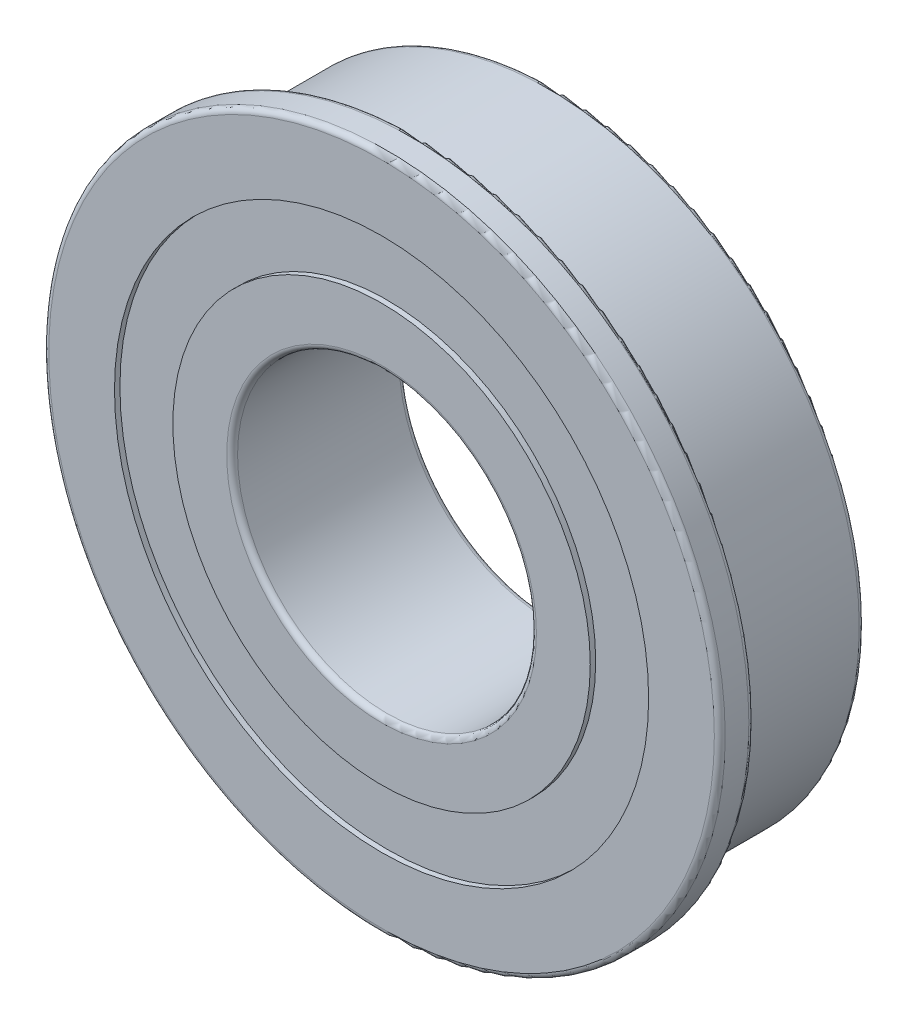
ISO-10303-21;
HEADER;
FILE_DESCRIPTION(('STEP AP214'),'2;1');
FILE_NAME('part.step','',(''),(''),'','','');
FILE_SCHEMA(('AUTOMOTIVE_DESIGN { 1 0 10303 214 1 1 1 1 }'));
ENDSEC;
DATA;
#1=APPLICATION_CONTEXT('core data for automotive mechanical design processes');
#2=APPLICATION_PROTOCOL_DEFINITION('international standard','automotive_design',2000,#1);
#3=PRODUCT_CONTEXT('',#1,'mechanical');
#4=PRODUCT('Part','Part','',(#3));
#5=PRODUCT_RELATED_PRODUCT_CATEGORY('part','',(#4));
#6=PRODUCT_DEFINITION_FORMATION('','',#4);
#7=PRODUCT_DEFINITION_CONTEXT('part definition',#1,'design');
#8=PRODUCT_DEFINITION('design','',#6,#7);
#9=PRODUCT_DEFINITION_SHAPE('','',#8);
#10=(LENGTH_UNIT() NAMED_UNIT(*) SI_UNIT(.MILLI.,.METRE.));
#11=(NAMED_UNIT(*) PLANE_ANGLE_UNIT() SI_UNIT($,.RADIAN.));
#12=(NAMED_UNIT(*) SI_UNIT($,.STERADIAN.) SOLID_ANGLE_UNIT());
#13=UNCERTAINTY_MEASURE_WITH_UNIT(LENGTH_MEASURE(1.E-05),#10,'distance_accuracy_value','');
#14=(GEOMETRIC_REPRESENTATION_CONTEXT(3) GLOBAL_UNCERTAINTY_ASSIGNED_CONTEXT((#13)) GLOBAL_UNIT_ASSIGNED_CONTEXT((#10,
#11,#12)) REPRESENTATION_CONTEXT('',''));
#15=CARTESIAN_POINT('',(0.,0.,0.));
#16=DIRECTION('',(0.,0.,1.));
#17=DIRECTION('',(1.,0.,0.));
#18=AXIS2_PLACEMENT_3D('',#15,#16,#17);
#19=CARTESIAN_POINT('',(0.,0.,-3.7187500000015));
#20=DIRECTION('',(0.,0.,1.));
#21=DIRECTION('',(1.,0.,0.));
#22=AXIS2_PLACEMENT_3D('',#19,#20,#21);
#23=TOROIDAL_SURFACE('',#22,14.0375000000005,0.249999999999001);
#24=CARTESIAN_POINT('',(0.,0.,-3.9687500000005));
#25=DIRECTION('',(0.,0.,1.));
#26=DIRECTION('',(1.,0.,0.));
#27=AXIS2_PLACEMENT_3D('',#24,#25,#26);
#28=CIRCLE('',#27,14.0375000000005);
#29=CARTESIAN_POINT('',(14.0375000000005,0.,-3.9687500000005));
#30=VERTEX_POINT('',#29);
#31=EDGE_CURVE('E10',#30,#30,#28,.T.);
#32=ORIENTED_EDGE('',*,*,#31,.T.);
#33=EDGE_LOOP('',(#32));
#34=FACE_BOUND('',#33,.T.);
#35=CARTESIAN_POINT('',(0.,0.,-3.7187500000015));
#36=DIRECTION('',(0.,0.,1.));
#37=DIRECTION('',(1.,0.,0.));
#38=AXIS2_PLACEMENT_3D('',#35,#36,#37);
#39=CIRCLE('',#38,14.2874999999995);
#40=CARTESIAN_POINT('',(14.2874999999995,0.,-3.7187500000015));
#41=VERTEX_POINT('',#40);
#42=EDGE_CURVE('E97',#41,#41,#39,.T.);
#43=ORIENTED_EDGE('',*,*,#42,.F.);
#44=EDGE_LOOP('',(#43));
#45=FACE_BOUND('',#44,.T.);
#46=ADVANCED_FACE('F30',(#34,#45),#23,.T.);
#47=CARTESIAN_POINT('',(14.0375000000005,0.,-3.9687500000005));
#48=DIRECTION('',(0.,0.,-1.));
#49=DIRECTION('',(-1.,0.,0.));
#50=AXIS2_PLACEMENT_3D('',#47,#48,#49);
#51=PLANE('',#50);
#52=CARTESIAN_POINT('',(0.,0.,-3.9687500000005));
#53=DIRECTION('',(0.,0.,1.));
#54=DIRECTION('',(1.,0.,0.));
#55=AXIS2_PLACEMENT_3D('',#52,#53,#54);
#56=CIRCLE('',#55,12.2875000000004);
#57=CARTESIAN_POINT('',(12.2875000000004,0.,-3.9687500000005));
#58=VERTEX_POINT('',#57);
#59=EDGE_CURVE('E36',#58,#58,#56,.T.);
#60=ORIENTED_EDGE('',*,*,#59,.T.);
#61=EDGE_LOOP('',(#60));
#62=FACE_BOUND('',#61,.T.);
#63=ORIENTED_EDGE('',*,*,#31,.F.);
#64=EDGE_LOOP('',(#63));
#65=FACE_BOUND('',#64,.T.);
#66=ADVANCED_FACE('F105',(#62,#65),#51,.T.);
#67=CARTESIAN_POINT('',(0.,0.,-3.97000399362123));
#68=DIRECTION('',(0.,0.,1.));
#69=DIRECTION('',(1.,0.,0.));
#70=AXIS2_PLACEMENT_3D('',#67,#68,#69);
#71=CYLINDRICAL_SURFACE('',#70,12.2875000000004);
#72=CARTESIAN_POINT('',(0.,0.,-3.71875000000001));
#73=DIRECTION('',(0.,0.,1.));
#74=DIRECTION('',(1.,0.,0.));
#75=AXIS2_PLACEMENT_3D('',#72,#73,#74);
#76=CIRCLE('',#75,12.2875000000004);
#77=CARTESIAN_POINT('',(12.2875000000004,0.,-3.71875000000001));
#78=VERTEX_POINT('',#77);
#79=EDGE_CURVE('E40',#78,#78,#76,.T.);
#80=ORIENTED_EDGE('',*,*,#79,.T.);
#81=EDGE_LOOP('',(#80));
#82=FACE_BOUND('',#81,.T.);
#83=ORIENTED_EDGE('',*,*,#59,.F.);
#84=EDGE_LOOP('',(#83));
#85=FACE_BOUND('',#84,.T.);
#86=ADVANCED_FACE('F109',(#82,#85),#71,.F.);
#87=CARTESIAN_POINT('',(12.2875000000004,0.,-3.71875000000001));
#88=DIRECTION('',(0.,0.,-1.));
#89=DIRECTION('',(-1.,0.,0.));
#90=AXIS2_PLACEMENT_3D('',#87,#88,#89);
#91=PLANE('',#90);
#92=CARTESIAN_POINT('',(0.,0.,-3.71875000000001));
#93=DIRECTION('',(0.,0.,1.));
#94=DIRECTION('',(1.,0.,0.));
#95=AXIS2_PLACEMENT_3D('',#92,#93,#94);
#96=CIRCLE('',#95,9.6020000000002);
#97=CARTESIAN_POINT('',(9.6020000000002,0.,-3.71875000000001));
#98=VERTEX_POINT('',#97);
#99=EDGE_CURVE('E44',#98,#98,#96,.T.);
#100=ORIENTED_EDGE('',*,*,#99,.T.);
#101=EDGE_LOOP('',(#100));
#102=FACE_BOUND('',#101,.T.);
#103=ORIENTED_EDGE('',*,*,#79,.F.);
#104=EDGE_LOOP('',(#103));
#105=FACE_BOUND('',#104,.T.);
#106=ADVANCED_FACE('F113',(#102,#105),#91,.T.);
#107=CARTESIAN_POINT('',(0.,0.,-3.97000399362123));
#108=DIRECTION('',(0.,0.,1.));
#109=DIRECTION('',(1.,0.,0.));
#110=AXIS2_PLACEMENT_3D('',#107,#108,#109);
#111=CYLINDRICAL_SURFACE('',#110,9.6020000000002);
#112=CARTESIAN_POINT('',(0.,0.,-3.9687500000005));
#113=DIRECTION('',(0.,0.,1.));
#114=DIRECTION('',(1.,0.,0.));
#115=AXIS2_PLACEMENT_3D('',#112,#113,#114);
#116=CIRCLE('',#115,9.6020000000002);
#117=CARTESIAN_POINT('',(9.6020000000002,0.,-3.9687500000005));
#118=VERTEX_POINT('',#117);
#119=EDGE_CURVE('E49',#118,#118,#116,.T.);
#120=ORIENTED_EDGE('',*,*,#119,.T.);
#121=EDGE_LOOP('',(#120));
#122=FACE_BOUND('',#121,.T.);
#123=ORIENTED_EDGE('',*,*,#99,.F.);
#124=EDGE_LOOP('',(#123));
#125=FACE_BOUND('',#124,.T.);
#126=ADVANCED_FACE('F120',(#122,#125),#111,.T.);
#127=CARTESIAN_POINT('',(9.6020000000002,0.,-3.96875000000049));
#128=DIRECTION('',(0.,0.,-1.));
#129=DIRECTION('',(-1.,0.,0.));
#130=AXIS2_PLACEMENT_3D('',#127,#128,#129);
#131=PLANE('',#130);
#132=CARTESIAN_POINT('',(0.,0.,-3.96875000000049));
#133=DIRECTION('',(0.,0.,1.));
#134=DIRECTION('',(1.,0.,0.));
#135=AXIS2_PLACEMENT_3D('',#132,#133,#134);
#136=CIRCLE('',#135,7.12499999999894);
#137=CARTESIAN_POINT('',(7.12499999999894,0.,-3.96875000000049));
#138=VERTEX_POINT('',#137);
#139=EDGE_CURVE('E52',#138,#138,#136,.T.);
#140=ORIENTED_EDGE('',*,*,#139,.T.);
#141=EDGE_LOOP('',(#140));
#142=FACE_BOUND('',#141,.T.);
#143=ORIENTED_EDGE('',*,*,#119,.F.);
#144=EDGE_LOOP('',(#143));
#145=FACE_BOUND('',#144,.T.);
#146=ADVANCED_FACE('F124',(#142,#145),#131,.T.);
#147=CARTESIAN_POINT('',(0.,0.,-3.718750000001));
#148=DIRECTION('',(0.,0.,1.));
#149=DIRECTION('',(1.,0.,0.));
#150=AXIS2_PLACEMENT_3D('',#147,#148,#149);
#151=TOROIDAL_SURFACE('',#150,7.12499999999894,0.249999999999495);
#152=CARTESIAN_POINT('',(0.,0.,-3.718750000001));
#153=DIRECTION('',(0.,0.,1.));
#154=DIRECTION('',(1.,0.,0.));
#155=AXIS2_PLACEMENT_3D('',#152,#153,#154);
#156=CIRCLE('',#155,6.87499999999945);
#157=CARTESIAN_POINT('',(6.87499999999945,0.,-3.718750000001));
#158=VERTEX_POINT('',#157);
#159=EDGE_CURVE('E55',#158,#158,#156,.T.);
#160=ORIENTED_EDGE('',*,*,#159,.T.);
#161=EDGE_LOOP('',(#160));
#162=FACE_BOUND('',#161,.T.);
#163=ORIENTED_EDGE('',*,*,#139,.F.);
#164=EDGE_LOOP('',(#163));
#165=FACE_BOUND('',#164,.T.);
#166=ADVANCED_FACE('F128',(#162,#165),#151,.T.);
#167=CARTESIAN_POINT('',(0.,0.,-3.97000399362123));
#168=DIRECTION('',(0.,0.,1.));
#169=DIRECTION('',(1.,0.,0.));
#170=AXIS2_PLACEMENT_3D('',#167,#168,#169);
#171=CYLINDRICAL_SURFACE('',#170,6.87499999999945);
#172=CARTESIAN_POINT('',(0.,0.,3.718750000001));
#173=DIRECTION('',(0.,0.,1.));
#174=DIRECTION('',(1.,0.,0.));
#175=AXIS2_PLACEMENT_3D('',#172,#173,#174);
#176=CIRCLE('',#175,6.87499999999945);
#177=CARTESIAN_POINT('',(6.87499999999945,0.,3.718750000001));
#178=VERTEX_POINT('',#177);
#179=EDGE_CURVE('E58',#178,#178,#176,.T.);
#180=ORIENTED_EDGE('',*,*,#179,.T.);
#181=EDGE_LOOP('',(#180));
#182=FACE_BOUND('',#181,.T.);
#183=ORIENTED_EDGE('',*,*,#159,.F.);
#184=EDGE_LOOP('',(#183));
#185=FACE_BOUND('',#184,.T.);
#186=ADVANCED_FACE('F132',(#182,#185),#171,.F.);
#187=CARTESIAN_POINT('',(0.,0.,3.718750000001));
#188=DIRECTION('',(0.,0.,1.));
#189=DIRECTION('',(1.,0.,0.));
#190=AXIS2_PLACEMENT_3D('',#187,#188,#189);
#191=TOROIDAL_SURFACE('',#190,7.12499999999944,0.249999999999991);
#192=CARTESIAN_POINT('',(0.,0.,3.96875000000099));
#193=DIRECTION('',(0.,0.,1.));
#194=DIRECTION('',(1.,0.,0.));
#195=AXIS2_PLACEMENT_3D('',#192,#193,#194);
#196=CIRCLE('',#195,7.12499999999944);
#197=CARTESIAN_POINT('',(7.12499999999944,0.,3.96875000000099));
#198=VERTEX_POINT('',#197);
#199=EDGE_CURVE('E61',#198,#198,#196,.T.);
#200=ORIENTED_EDGE('',*,*,#199,.T.);
#201=EDGE_LOOP('',(#200));
#202=FACE_BOUND('',#201,.T.);
#203=ORIENTED_EDGE('',*,*,#179,.F.);
#204=EDGE_LOOP('',(#203));
#205=FACE_BOUND('',#204,.T.);
#206=ADVANCED_FACE('F136',(#202,#205),#191,.T.);
#207=CARTESIAN_POINT('',(7.12499999999944,0.,3.96875000000099));
#208=DIRECTION('',(0.,0.,1.));
#209=DIRECTION('',(1.,0.,0.));
#210=AXIS2_PLACEMENT_3D('',#207,#208,#209);
#211=PLANE('',#210);
#212=CARTESIAN_POINT('',(0.,0.,3.96875000000099));
#213=DIRECTION('',(0.,0.,1.));
#214=DIRECTION('',(1.,0.,0.));
#215=AXIS2_PLACEMENT_3D('',#212,#213,#214);
#216=CIRCLE('',#215,9.6020000000002);
#217=CARTESIAN_POINT('',(9.6020000000002,0.,3.96875000000099));
#218=VERTEX_POINT('',#217);
#219=EDGE_CURVE('E64',#218,#218,#216,.T.);
#220=ORIENTED_EDGE('',*,*,#219,.T.);
#221=EDGE_LOOP('',(#220));
#222=FACE_BOUND('',#221,.T.);
#223=ORIENTED_EDGE('',*,*,#199,.F.);
#224=EDGE_LOOP('',(#223));
#225=FACE_BOUND('',#224,.T.);
#226=ADVANCED_FACE('F140',(#222,#225),#211,.T.);
#227=CARTESIAN_POINT('',(0.,0.,-3.97000399362123));
#228=DIRECTION('',(0.,0.,1.));
#229=DIRECTION('',(1.,0.,0.));
#230=AXIS2_PLACEMENT_3D('',#227,#228,#229);
#231=CYLINDRICAL_SURFACE('',#230,9.6020000000002);
#232=CARTESIAN_POINT('',(0.,0.,3.71875000000199));
#233=DIRECTION('',(0.,0.,1.));
#234=DIRECTION('',(1.,0.,0.));
#235=AXIS2_PLACEMENT_3D('',#232,#233,#234);
#236=CIRCLE('',#235,9.6020000000002);
#237=CARTESIAN_POINT('',(9.6020000000002,0.,3.71875000000199));
#238=VERTEX_POINT('',#237);
#239=EDGE_CURVE('E67',#238,#238,#236,.T.);
#240=ORIENTED_EDGE('',*,*,#239,.T.);
#241=EDGE_LOOP('',(#240));
#242=FACE_BOUND('',#241,.T.);
#243=ORIENTED_EDGE('',*,*,#219,.F.);
#244=EDGE_LOOP('',(#243));
#245=FACE_BOUND('',#244,.T.);
#246=ADVANCED_FACE('F144',(#242,#245),#231,.T.);
#247=CARTESIAN_POINT('',(9.6020000000002,0.,3.71875000000199));
#248=DIRECTION('',(0.,0.,1.));
#249=DIRECTION('',(1.,0.,0.));
#250=AXIS2_PLACEMENT_3D('',#247,#248,#249);
#251=PLANE('',#250);
#252=CARTESIAN_POINT('',(0.,0.,3.71875000000199));
#253=DIRECTION('',(0.,0.,1.));
#254=DIRECTION('',(1.,0.,0.));
#255=AXIS2_PLACEMENT_3D('',#252,#253,#254);
#256=CIRCLE('',#255,12.2875000000004);
#257=CARTESIAN_POINT('',(12.2875000000004,0.,3.71875000000199));
#258=VERTEX_POINT('',#257);
#259=EDGE_CURVE('E70',#258,#258,#256,.T.);
#260=ORIENTED_EDGE('',*,*,#259,.T.);
#261=EDGE_LOOP('',(#260));
#262=FACE_BOUND('',#261,.T.);
#263=ORIENTED_EDGE('',*,*,#239,.F.);
#264=EDGE_LOOP('',(#263));
#265=FACE_BOUND('',#264,.T.);
#266=ADVANCED_FACE('F148',(#262,#265),#251,.T.);
#267=CARTESIAN_POINT('',(0.,0.,-3.97000399362123));
#268=DIRECTION('',(0.,0.,1.));
#269=DIRECTION('',(1.,0.,0.));
#270=AXIS2_PLACEMENT_3D('',#267,#268,#269);
#271=CYLINDRICAL_SURFACE('',#270,12.2875000000004);
#272=CARTESIAN_POINT('',(0.,0.,3.96875000000099));
#273=DIRECTION('',(0.,0.,1.));
#274=DIRECTION('',(1.,0.,0.));
#275=AXIS2_PLACEMENT_3D('',#272,#273,#274);
#276=CIRCLE('',#275,12.2875000000004);
#277=CARTESIAN_POINT('',(12.2875000000004,0.,3.96875000000099));
#278=VERTEX_POINT('',#277);
#279=EDGE_CURVE('E73',#278,#278,#276,.T.);
#280=ORIENTED_EDGE('',*,*,#279,.T.);
#281=EDGE_LOOP('',(#280));
#282=FACE_BOUND('',#281,.T.);
#283=ORIENTED_EDGE('',*,*,#259,.F.);
#284=EDGE_LOOP('',(#283));
#285=FACE_BOUND('',#284,.T.);
#286=ADVANCED_FACE('F152',(#282,#285),#271,.F.);
#287=CARTESIAN_POINT('',(12.2875000000004,0.,3.96875000000099));
#288=DIRECTION('',(0.,0.,1.));
#289=DIRECTION('',(1.,0.,0.));
#290=AXIS2_PLACEMENT_3D('',#287,#288,#289);
#291=PLANE('',#290);
#292=CARTESIAN_POINT('',(0.,0.,3.96875000000099));
#293=DIRECTION('',(0.,0.,1.));
#294=DIRECTION('',(1.,0.,0.));
#295=AXIS2_PLACEMENT_3D('',#292,#293,#294);
#296=CIRCLE('',#295,15.3099999999997);
#297=CARTESIAN_POINT('',(15.3099999999997,0.,3.96875000000099));
#298=VERTEX_POINT('',#297);
#299=EDGE_CURVE('E76',#298,#298,#296,.T.);
#300=ORIENTED_EDGE('',*,*,#299,.T.);
#301=EDGE_LOOP('',(#300));
#302=FACE_BOUND('',#301,.T.);
#303=ORIENTED_EDGE('',*,*,#279,.F.);
#304=EDGE_LOOP('',(#303));
#305=FACE_BOUND('',#304,.T.);
#306=ADVANCED_FACE('F156',(#302,#305),#291,.T.);
#307=CARTESIAN_POINT('',(0.,0.,3.7187500000015));
#308=DIRECTION('',(0.,0.,1.));
#309=DIRECTION('',(1.,0.,0.));
#310=AXIS2_PLACEMENT_3D('',#307,#308,#309);
#311=TOROIDAL_SURFACE('',#310,15.3099999999997,0.249999999999496);
#312=CARTESIAN_POINT('',(0.,0.,3.7187500000015));
#313=DIRECTION('',(0.,0.,1.));
#314=DIRECTION('',(1.,0.,0.));
#315=AXIS2_PLACEMENT_3D('',#312,#313,#314);
#316=CIRCLE('',#315,15.5599999999992);
#317=CARTESIAN_POINT('',(15.5599999999992,0.,3.7187500000015));
#318=VERTEX_POINT('',#317);
#319=EDGE_CURVE('E79',#318,#318,#316,.T.);
#320=ORIENTED_EDGE('',*,*,#319,.T.);
#321=EDGE_LOOP('',(#320));
#322=FACE_BOUND('',#321,.T.);
#323=ORIENTED_EDGE('',*,*,#299,.F.);
#324=EDGE_LOOP('',(#323));
#325=FACE_BOUND('',#324,.T.);
#326=ADVANCED_FACE('F160',(#322,#325),#311,.T.);
#327=CARTESIAN_POINT('',(0.,0.,-3.97000399362123));
#328=DIRECTION('',(0.,0.,1.));
#329=DIRECTION('',(1.,0.,0.));
#330=AXIS2_PLACEMENT_3D('',#327,#328,#329);
#331=CYLINDRICAL_SURFACE('',#330,15.5599999999992);
#332=CARTESIAN_POINT('',(0.,0.,2.63125000000075));
#333=DIRECTION('',(0.,0.,1.));
#334=DIRECTION('',(1.,0.,0.));
#335=AXIS2_PLACEMENT_3D('',#332,#333,#334);
#336=CIRCLE('',#335,15.5599999999992);
#337=CARTESIAN_POINT('',(15.5599999999992,0.,2.63125000000075));
#338=VERTEX_POINT('',#337);
#339=EDGE_CURVE('E82',#338,#338,#336,.T.);
#340=ORIENTED_EDGE('',*,*,#339,.T.);
#341=EDGE_LOOP('',(#340));
#342=FACE_BOUND('',#341,.T.);
#343=ORIENTED_EDGE('',*,*,#319,.F.);
#344=EDGE_LOOP('',(#343));
#345=FACE_BOUND('',#344,.T.);
#346=ADVANCED_FACE('F164',(#342,#345),#331,.T.);
#347=CARTESIAN_POINT('',(0.,0.,2.63125000000075));
#348=DIRECTION('',(0.,0.,1.));
#349=DIRECTION('',(1.,0.,0.));
#350=AXIS2_PLACEMENT_3D('',#347,#348,#349);
#351=TOROIDAL_SURFACE('',#350,15.3099999999984,0.250000000000766);
#352=CARTESIAN_POINT('',(0.,0.,2.38124999999998));
#353=DIRECTION('',(0.,0.,1.));
#354=DIRECTION('',(1.,0.,0.));
#355=AXIS2_PLACEMENT_3D('',#352,#353,#354);
#356=CIRCLE('',#355,15.3099999999984);
#357=CARTESIAN_POINT('',(15.3099999999984,0.,2.38124999999998));
#358=VERTEX_POINT('',#357);
#359=EDGE_CURVE('E85',#358,#358,#356,.T.);
#360=ORIENTED_EDGE('',*,*,#359,.T.);
#361=EDGE_LOOP('',(#360));
#362=FACE_BOUND('',#361,.T.);
#363=ORIENTED_EDGE('',*,*,#339,.F.);
#364=EDGE_LOOP('',(#363));
#365=FACE_BOUND('',#364,.T.);
#366=ADVANCED_FACE('F168',(#362,#365),#351,.T.);
#367=CARTESIAN_POINT('',(15.3099999999984,0.,2.38124999999999));
#368=DIRECTION('',(0.,0.,-1.));
#369=DIRECTION('',(-1.,0.,0.));
#370=AXIS2_PLACEMENT_3D('',#367,#368,#369);
#371=PLANE('',#370);
#372=CARTESIAN_POINT('',(0.,0.,2.38124999999999));
#373=DIRECTION('',(0.,0.,1.));
#374=DIRECTION('',(1.,0.,0.));
#375=AXIS2_PLACEMENT_3D('',#372,#373,#374);
#376=CIRCLE('',#375,14.2874999999995);
#377=CARTESIAN_POINT('',(14.2874999999995,0.,2.38124999999999));
#378=VERTEX_POINT('',#377);
#379=EDGE_CURVE('E88',#378,#378,#376,.T.);
#380=ORIENTED_EDGE('',*,*,#379,.T.);
#381=EDGE_LOOP('',(#380));
#382=FACE_BOUND('',#381,.T.);
#383=ORIENTED_EDGE('',*,*,#359,.F.);
#384=EDGE_LOOP('',(#383));
#385=FACE_BOUND('',#384,.T.);
#386=ADVANCED_FACE('F172',(#382,#385),#371,.T.);
#387=CARTESIAN_POINT('',(0.,0.,2.13124999999998));
#388=DIRECTION('',(0.,0.,1.));
#389=DIRECTION('',(1.,0.,0.));
#390=AXIS2_PLACEMENT_3D('',#387,#388,#389);
#391=TOROIDAL_SURFACE('',#390,14.2874999999995,0.250000000000003);
#392=CARTESIAN_POINT('',(0.,0.,2.00624999999998));
#393=DIRECTION('',(0.,0.,1.));
#394=DIRECTION('',(1.,0.,0.));
#395=AXIS2_PLACEMENT_3D('',#392,#393,#394);
#396=CIRCLE('',#395,14.0709936490534);
#397=CARTESIAN_POINT('',(14.0709936490534,0.,2.00624999999998));
#398=VERTEX_POINT('',#397);
#399=EDGE_CURVE('E91',#398,#398,#396,.T.);
#400=ORIENTED_EDGE('',*,*,#399,.T.);
#401=EDGE_LOOP('',(#400));
#402=FACE_BOUND('',#401,.T.);
#403=ORIENTED_EDGE('',*,*,#379,.F.);
#404=EDGE_LOOP('',(#403));
#405=FACE_BOUND('',#404,.T.);
#406=ADVANCED_FACE('F176',(#402,#405),#391,.F.);
#407=CARTESIAN_POINT('',(0.,0.,2.00624999999998));
#408=DIRECTION('',(0.,0.,-1.));
#409=DIRECTION('',(-1.,0.,0.));
#410=AXIS2_PLACEMENT_3D('',#407,#408,#409);
#411=CONICAL_SURFACE('',#410,14.0709936490534,0.5235987755983);
#412=CARTESIAN_POINT('',(0.,0.,1.63124999999996));
#413=DIRECTION('',(0.,0.,1.));
#414=DIRECTION('',(1.,0.,0.));
#415=AXIS2_PLACEMENT_3D('',#412,#413,#414);
#416=CIRCLE('',#415,14.2874999999995);
#417=CARTESIAN_POINT('',(14.2874999999995,0.,1.63124999999996));
#418=VERTEX_POINT('',#417);
#419=EDGE_CURVE('E94',#418,#418,#416,.T.);
#420=ORIENTED_EDGE('',*,*,#419,.T.);
#421=EDGE_LOOP('',(#420));
#422=FACE_BOUND('',#421,.T.);
#423=ORIENTED_EDGE('',*,*,#399,.F.);
#424=EDGE_LOOP('',(#423));
#425=FACE_BOUND('',#424,.T.);
#426=ADVANCED_FACE('F180',(#422,#425),#411,.T.);
#427=CARTESIAN_POINT('',(0.,0.,-3.97000399362123));
#428=DIRECTION('',(0.,0.,1.));
#429=DIRECTION('',(1.,0.,0.));
#430=AXIS2_PLACEMENT_3D('',#427,#428,#429);
#431=CYLINDRICAL_SURFACE('',#430,14.2874999999995);
#432=ORIENTED_EDGE('',*,*,#42,.T.);
#433=EDGE_LOOP('',(#432));
#434=FACE_BOUND('',#433,.T.);
#435=ORIENTED_EDGE('',*,*,#419,.F.);
#436=EDGE_LOOP('',(#435));
#437=FACE_BOUND('',#436,.T.);
#438=ADVANCED_FACE('F101',(#434,#437),#431,.T.);
#439=CLOSED_SHELL('',(#46,#66,#86,#106,#126,#146,#166,#186,#206,#226,#246,#266,#286,#306,#326,
#346,#366,#386,#406,#426,#438));
#440=MANIFOLD_SOLID_BREP('B2',#439);
#441=ADVANCED_BREP_SHAPE_REPRESENTATION('',(#18,#440),#14);
#442=SHAPE_DEFINITION_REPRESENTATION(#9,#441);
ENDSEC;
END-ISO-10303-21;
